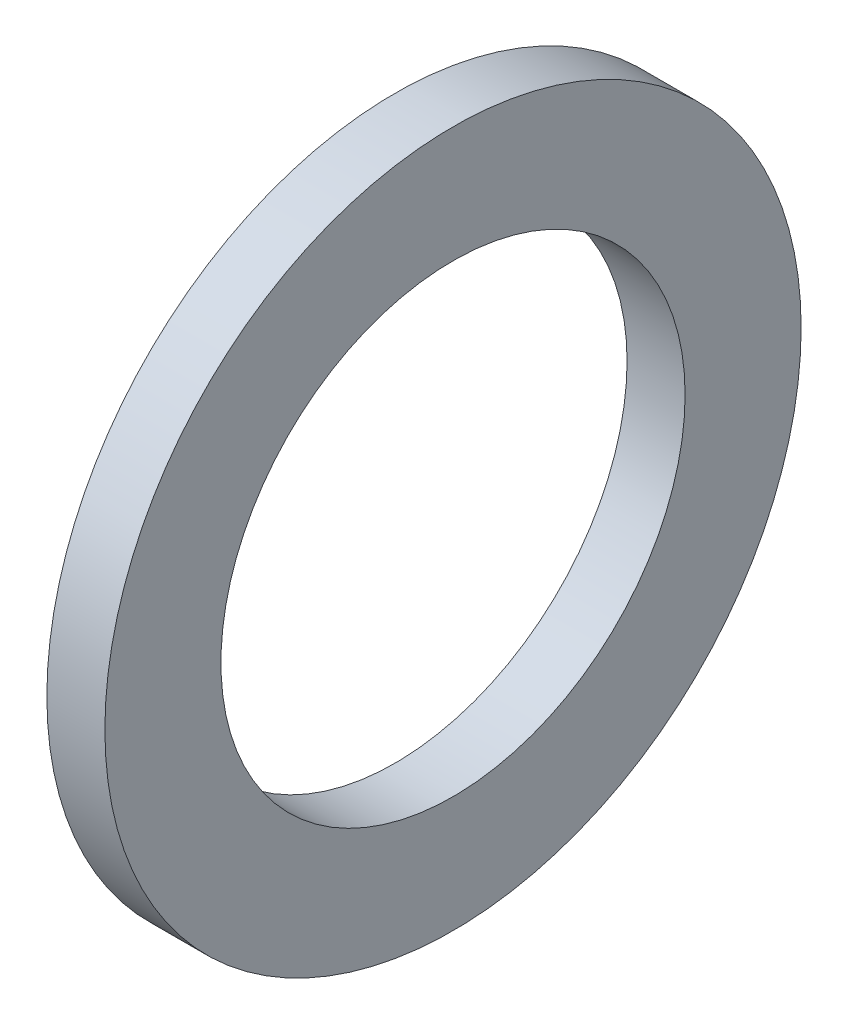
ISO-10303-21;
HEADER;
FILE_DESCRIPTION(('STEP AP214'),'2;1');
FILE_NAME('part.step','',(''),(''),'','','');
FILE_SCHEMA(('AUTOMOTIVE_DESIGN { 1 0 10303 214 1 1 1 1 }'));
ENDSEC;
DATA;
#1=APPLICATION_CONTEXT('core data for automotive mechanical design processes');
#2=APPLICATION_PROTOCOL_DEFINITION('international standard','automotive_design',2000,#1);
#3=PRODUCT_CONTEXT('',#1,'mechanical');
#4=PRODUCT('Part','Part','',(#3));
#5=PRODUCT_RELATED_PRODUCT_CATEGORY('part','',(#4));
#6=PRODUCT_DEFINITION_FORMATION('','',#4);
#7=PRODUCT_DEFINITION_CONTEXT('part definition',#1,'design');
#8=PRODUCT_DEFINITION('design','',#6,#7);
#9=PRODUCT_DEFINITION_SHAPE('','',#8);
#10=(LENGTH_UNIT() NAMED_UNIT(*) SI_UNIT(.MILLI.,.METRE.));
#11=(NAMED_UNIT(*) PLANE_ANGLE_UNIT() SI_UNIT($,.RADIAN.));
#12=(NAMED_UNIT(*) SI_UNIT($,.STERADIAN.) SOLID_ANGLE_UNIT());
#13=UNCERTAINTY_MEASURE_WITH_UNIT(LENGTH_MEASURE(1.E-05),#10,'distance_accuracy_value','');
#14=(GEOMETRIC_REPRESENTATION_CONTEXT(3) GLOBAL_UNCERTAINTY_ASSIGNED_CONTEXT((#13)) GLOBAL_UNIT_ASSIGNED_CONTEXT((#10,
#11,#12)) REPRESENTATION_CONTEXT('',''));
#15=CARTESIAN_POINT('',(0.,0.,0.));
#16=DIRECTION('',(0.,0.,1.));
#17=DIRECTION('',(1.,0.,0.));
#18=AXIS2_PLACEMENT_3D('',#15,#16,#17);
#19=CARTESIAN_POINT('',(3.175,0.,0.));
#20=DIRECTION('',(1.,0.,0.));
#21=DIRECTION('',(0.,0.,-1.));
#22=AXIS2_PLACEMENT_3D('',#19,#20,#21);
#23=PLANE('',#22);
#24=CARTESIAN_POINT('',(3.175,0.,0.));
#25=DIRECTION('',(1.,0.,0.));
#26=DIRECTION('',(0.,0.,-1.));
#27=AXIS2_PLACEMENT_3D('',#24,#25,#26);
#28=CIRCLE('',#27,19.05);
#29=CARTESIAN_POINT('',(3.175,0.,-19.05));
#30=VERTEX_POINT('',#29);
#31=EDGE_CURVE('E10',#30,#30,#28,.T.);
#32=ORIENTED_EDGE('',*,*,#31,.T.);
#33=EDGE_LOOP('',(#32));
#34=FACE_BOUND('',#33,.T.);
#35=CARTESIAN_POINT('',(3.175,0.,0.));
#36=DIRECTION('',(1.,0.,0.));
#37=DIRECTION('',(0.,0.,-1.));
#38=AXIS2_PLACEMENT_3D('',#35,#36,#37);
#39=CIRCLE('',#38,12.7);
#40=CARTESIAN_POINT('',(3.175,0.,-12.7));
#41=VERTEX_POINT('',#40);
#42=EDGE_CURVE('E42',#41,#41,#39,.T.);
#43=ORIENTED_EDGE('',*,*,#42,.F.);
#44=EDGE_LOOP('',(#43));
#45=FACE_BOUND('',#44,.T.);
#46=ADVANCED_FACE('F31',(#34,#45),#23,.T.);
#47=CARTESIAN_POINT('',(0.,0.,0.));
#48=DIRECTION('',(1.,0.,0.));
#49=DIRECTION('',(0.,0.,-1.));
#50=AXIS2_PLACEMENT_3D('',#47,#48,#49);
#51=PLANE('',#50);
#52=CARTESIAN_POINT('',(0.,0.,0.));
#53=DIRECTION('',(1.,0.,0.));
#54=DIRECTION('',(0.,0.,-1.));
#55=AXIS2_PLACEMENT_3D('',#52,#53,#54);
#56=CIRCLE('',#55,19.05);
#57=CARTESIAN_POINT('',(0.,0.,-19.05));
#58=VERTEX_POINT('',#57);
#59=EDGE_CURVE('E35',#58,#58,#56,.T.);
#60=ORIENTED_EDGE('',*,*,#59,.F.);
#61=EDGE_LOOP('',(#60));
#62=FACE_BOUND('',#61,.T.);
#63=CARTESIAN_POINT('',(0.,0.,0.));
#64=DIRECTION('',(1.,0.,0.));
#65=DIRECTION('',(0.,0.,-1.));
#66=AXIS2_PLACEMENT_3D('',#63,#64,#65);
#67=CIRCLE('',#66,12.7);
#68=CARTESIAN_POINT('',(0.,0.,-12.7));
#69=VERTEX_POINT('',#68);
#70=EDGE_CURVE('E44',#69,#69,#67,.T.);
#71=ORIENTED_EDGE('',*,*,#70,.T.);
#72=EDGE_LOOP('',(#71));
#73=FACE_BOUND('',#72,.T.);
#74=ADVANCED_FACE('F54',(#62,#73),#51,.F.);
#75=CARTESIAN_POINT('',(3.175,0.,0.));
#76=DIRECTION('',(-1.,0.,0.));
#77=DIRECTION('',(0.,0.,1.));
#78=AXIS2_PLACEMENT_3D('',#75,#76,#77);
#79=CYLINDRICAL_SURFACE('',#78,19.05);
#80=ORIENTED_EDGE('',*,*,#31,.F.);
#81=EDGE_LOOP('',(#80));
#82=FACE_BOUND('',#81,.T.);
#83=ORIENTED_EDGE('',*,*,#59,.T.);
#84=EDGE_LOOP('',(#83));
#85=FACE_BOUND('',#84,.T.);
#86=ADVANCED_FACE('F33',(#82,#85),#79,.T.);
#87=CARTESIAN_POINT('',(3.175,0.,0.));
#88=DIRECTION('',(-1.,0.,0.));
#89=DIRECTION('',(0.,0.,1.));
#90=AXIS2_PLACEMENT_3D('',#87,#88,#89);
#91=CYLINDRICAL_SURFACE('',#90,12.7);
#92=ORIENTED_EDGE('',*,*,#42,.T.);
#93=EDGE_LOOP('',(#92));
#94=FACE_BOUND('',#93,.T.);
#95=ORIENTED_EDGE('',*,*,#70,.F.);
#96=EDGE_LOOP('',(#95));
#97=FACE_BOUND('',#96,.T.);
#98=ADVANCED_FACE('F50',(#94,#97),#91,.F.);
#99=CLOSED_SHELL('',(#46,#74,#86,#98));
#100=MANIFOLD_SOLID_BREP('B2',#99);
#101=ADVANCED_BREP_SHAPE_REPRESENTATION('',(#18,#100),#14);
#102=SHAPE_DEFINITION_REPRESENTATION(#9,#101);
ENDSEC;
END-ISO-10303-21;
